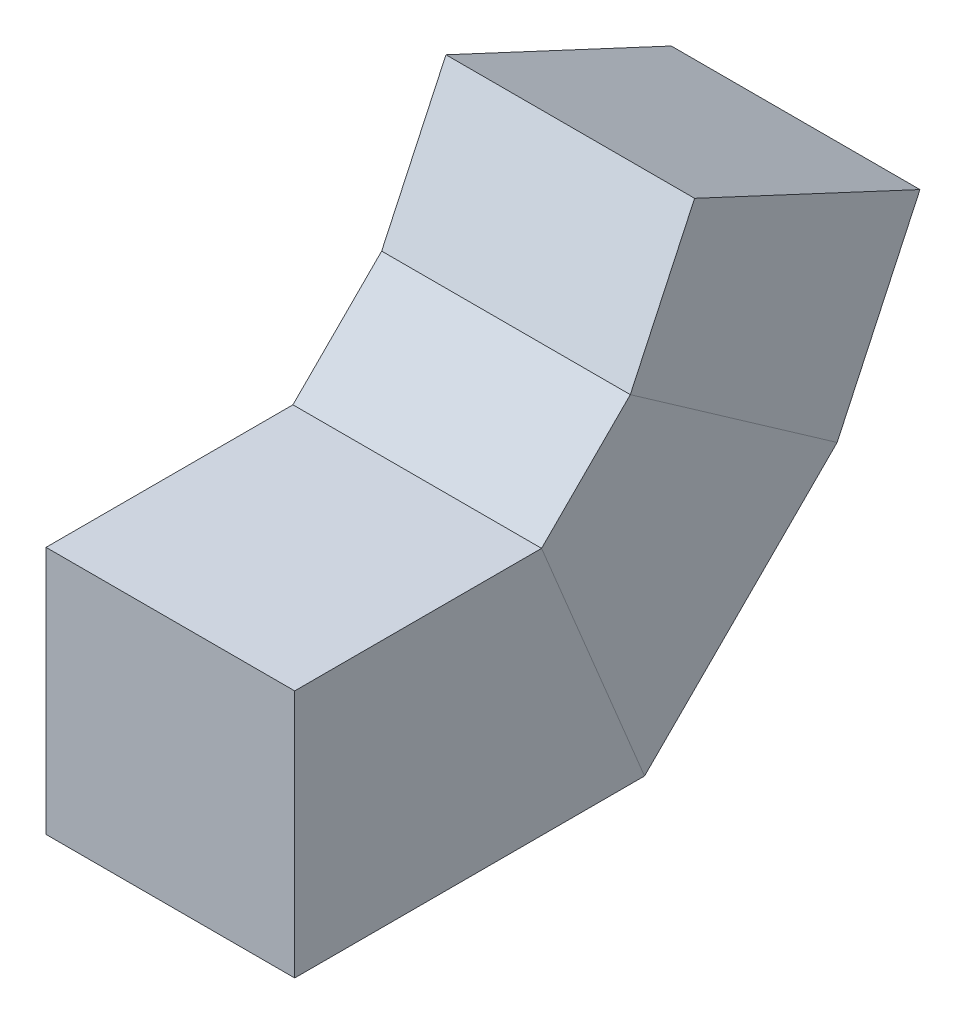
ISO-10303-21;
HEADER;
FILE_DESCRIPTION(('STEP AP214'),'2;1');
FILE_NAME('part.step','',(''),(''),'','','');
FILE_SCHEMA(('AUTOMOTIVE_DESIGN { 1 0 10303 214 1 1 1 1 }'));
ENDSEC;
DATA;
#1=APPLICATION_CONTEXT('core data for automotive mechanical design processes');
#2=APPLICATION_PROTOCOL_DEFINITION('international standard','automotive_design',2000,#1);
#3=PRODUCT_CONTEXT('',#1,'mechanical');
#4=PRODUCT('Part','Part','',(#3));
#5=PRODUCT_RELATED_PRODUCT_CATEGORY('part','',(#4));
#6=PRODUCT_DEFINITION_FORMATION('','',#4);
#7=PRODUCT_DEFINITION_CONTEXT('part definition',#1,'design');
#8=PRODUCT_DEFINITION('design','',#6,#7);
#9=PRODUCT_DEFINITION_SHAPE('','',#8);
#10=(LENGTH_UNIT() NAMED_UNIT(*) SI_UNIT(.MILLI.,.METRE.));
#11=(NAMED_UNIT(*) PLANE_ANGLE_UNIT() SI_UNIT($,.RADIAN.));
#12=(NAMED_UNIT(*) SI_UNIT($,.STERADIAN.) SOLID_ANGLE_UNIT());
#13=UNCERTAINTY_MEASURE_WITH_UNIT(LENGTH_MEASURE(1.E-05),#10,'distance_accuracy_value','');
#14=(GEOMETRIC_REPRESENTATION_CONTEXT(3) GLOBAL_UNCERTAINTY_ASSIGNED_CONTEXT((#13)) GLOBAL_UNIT_ASSIGNED_CONTEXT((#10,
#11,#12)) REPRESENTATION_CONTEXT('',''));
#15=CARTESIAN_POINT('',(0.,0.,0.));
#16=DIRECTION('',(0.,0.,1.));
#17=DIRECTION('',(1.,0.,0.));
#18=AXIS2_PLACEMENT_3D('',#15,#16,#17);
#19=CARTESIAN_POINT('',(0.,120.010087587489,-206.151820816773));
#20=DIRECTION('',(0.,0.90630778703665,-0.422618261740699));
#21=DIRECTION('',(-1.,0.,0.));
#22=AXIS2_PLACEMENT_3D('',#19,#20,#21);
#23=PLANE('',#22);
#24=DIRECTION('',(0.,-0.422618261740699,-0.90630778703665));
#25=VECTOR('',#24,1.);
#26=CARTESIAN_POINT('',(-50.,141.141000674524,-160.83643146494));
#27=LINE('',#26,#25);
#28=CARTESIAN_POINT('',(-50.,141.141000674524,-160.83643146494));
#29=VERTEX_POINT('',#28);
#30=CARTESIAN_POINT('',(-50.,98.8791745004545,-251.467210168605));
#31=VERTEX_POINT('',#30);
#32=EDGE_CURVE('E87',#29,#31,#27,.T.);
#33=ORIENTED_EDGE('',*,*,#32,.F.);
#34=DIRECTION('',(-1.,0.,0.));
#35=VECTOR('',#34,1.);
#36=CARTESIAN_POINT('',(50.,141.141000674524,-160.83643146494));
#37=LINE('',#36,#35);
#38=CARTESIAN_POINT('',(50.,141.141000674524,-160.83643146494));
#39=VERTEX_POINT('',#38);
#40=EDGE_CURVE('E94',#39,#29,#37,.T.);
#41=ORIENTED_EDGE('',*,*,#40,.F.);
#42=DIRECTION('',(0.,0.422618261740699,0.90630778703665));
#43=VECTOR('',#42,1.);
#44=CARTESIAN_POINT('',(50.,141.141000674524,-160.83643146494));
#45=LINE('',#44,#43);
#46=CARTESIAN_POINT('',(50.,98.8791745004544,-251.467210168605));
#47=VERTEX_POINT('',#46);
#48=EDGE_CURVE('E103',#47,#39,#45,.T.);
#49=ORIENTED_EDGE('',*,*,#48,.F.);
#50=DIRECTION('',(1.,0.,0.));
#51=VECTOR('',#50,1.);
#52=CARTESIAN_POINT('',(50.,98.8791745004544,-251.467210168605));
#53=LINE('',#52,#51);
#54=EDGE_CURVE('E105',#31,#47,#53,.T.);
#55=ORIENTED_EDGE('',*,*,#54,.F.);
#56=EDGE_LOOP('',(#33,#41,#49,#55));
#57=FACE_BOUND('',#56,.T.);
#58=ADVANCED_FACE('F39',(#57),#23,.T.);
#59=CARTESIAN_POINT('',(0.,0.,0.));
#60=DIRECTION('',(0.,0.,-1.));
#61=DIRECTION('',(-1.,0.,0.));
#62=AXIS2_PLACEMENT_3D('',#59,#60,#61);
#63=PLANE('',#62);
#64=DIRECTION('',(0.,-1.,0.));
#65=VECTOR('',#64,1.);
#66=CARTESIAN_POINT('',(-50.,50.,0.));
#67=LINE('',#66,#65);
#68=CARTESIAN_POINT('',(-50.,50.,0.));
#69=VERTEX_POINT('',#68);
#70=CARTESIAN_POINT('',(-50.,-50.,0.));
#71=VERTEX_POINT('',#70);
#72=EDGE_CURVE('E155',#69,#71,#67,.T.);
#73=ORIENTED_EDGE('',*,*,#72,.T.);
#74=DIRECTION('',(1.,0.,0.));
#75=VECTOR('',#74,1.);
#76=CARTESIAN_POINT('',(50.,-50.,0.));
#77=LINE('',#76,#75);
#78=CARTESIAN_POINT('',(50.,-50.,0.));
#79=VERTEX_POINT('',#78);
#80=EDGE_CURVE('E175',#71,#79,#77,.T.);
#81=ORIENTED_EDGE('',*,*,#80,.T.);
#82=DIRECTION('',(0.,1.,0.));
#83=VECTOR('',#82,1.);
#84=CARTESIAN_POINT('',(50.,50.,0.));
#85=LINE('',#84,#83);
#86=CARTESIAN_POINT('',(50.,50.,0.));
#87=VERTEX_POINT('',#86);
#88=EDGE_CURVE('E167',#79,#87,#85,.T.);
#89=ORIENTED_EDGE('',*,*,#88,.T.);
#90=DIRECTION('',(-1.,0.,0.));
#91=VECTOR('',#90,1.);
#92=CARTESIAN_POINT('',(50.,50.,0.));
#93=LINE('',#92,#91);
#94=EDGE_CURVE('E162',#87,#69,#93,.T.);
#95=ORIENTED_EDGE('',*,*,#94,.T.);
#96=EDGE_LOOP('',(#73,#81,#89,#95));
#97=FACE_BOUND('',#96,.T.);
#98=ADVANCED_FACE('F231',(#97),#63,.F.);
#99=CARTESIAN_POINT('',(-50.,68.8194664408142,-127.112346202242));
#100=DIRECTION('',(1.,0.,0.));
#101=DIRECTION('',(0.,0.,-1.));
#102=AXIS2_PLACEMENT_3D('',#99,#100,#101);
#103=PLANE('',#102);
#104=DIRECTION('',(0.,0.573576436351046,0.819152044288992));
#105=VECTOR('',#104,1.);
#106=CARTESIAN_POINT('',(-50.,95.0587422045921,-121.598840500455));
#107=LINE('',#106,#105);
#108=CARTESIAN_POINT('',(-50.,27.4473036238517,-218.157981742506));
#109=VERTEX_POINT('',#108);
#110=CARTESIAN_POINT('',(-50.,85.6897813659959,-134.979103247341));
#111=VERTEX_POINT('',#110);
#112=EDGE_CURVE('E110',#109,#111,#107,.T.);
#113=ORIENTED_EDGE('',*,*,#112,.T.);
#114=DIRECTION('',(0.,0.90630778703665,-0.422618261740699));
#115=VECTOR('',#114,1.);
#116=CARTESIAN_POINT('',(-50.,68.8194664408142,-127.112346202242));
#117=LINE('',#116,#115);
#118=EDGE_CURVE('E42',#111,#29,#117,.T.);
#119=ORIENTED_EDGE('',*,*,#118,.T.);
#120=ORIENTED_EDGE('',*,*,#32,.T.);
#121=DIRECTION('',(0.,0.90630778703665,-0.422618261740699));
#122=VECTOR('',#121,1.);
#123=CARTESIAN_POINT('',(-50.,26.5576402667443,-217.743124905907));
#124=LINE('',#123,#122);
#125=EDGE_CURVE('E114',#109,#31,#124,.T.);
#126=ORIENTED_EDGE('',*,*,#125,.F.);
#127=EDGE_LOOP('',(#113,#119,#120,#126));
#128=FACE_BOUND('',#127,.T.);
#129=ADVANCED_FACE('F109',(#128),#103,.F.);
#130=CARTESIAN_POINT('',(50.,26.5576402667443,-217.743124905907));
#131=DIRECTION('',(0.,0.422618261740698,0.90630778703665));
#132=DIRECTION('',(0.,-0.90630778703665,0.422618261740699));
#133=AXIS2_PLACEMENT_3D('',#130,#131,#132);
#134=PLANE('',#133);
#135=DIRECTION('',(-1.,0.,0.));
#136=VECTOR('',#135,1.);
#137=CARTESIAN_POINT('',(50.,27.4473036238517,-218.157981742506));
#138=LINE('',#137,#136);
#139=CARTESIAN_POINT('',(50.,27.4473036238517,-218.157981742506));
#140=VERTEX_POINT('',#139);
#141=EDGE_CURVE('E152',#140,#109,#138,.T.);
#142=ORIENTED_EDGE('',*,*,#141,.T.);
#143=ORIENTED_EDGE('',*,*,#125,.T.);
#144=ORIENTED_EDGE('',*,*,#54,.T.);
#145=DIRECTION('',(0.,0.90630778703665,-0.422618261740699));
#146=VECTOR('',#145,1.);
#147=CARTESIAN_POINT('',(50.,26.5576402667443,-217.743124905907));
#148=LINE('',#147,#146);
#149=EDGE_CURVE('E120',#140,#47,#148,.T.);
#150=ORIENTED_EDGE('',*,*,#149,.F.);
#151=EDGE_LOOP('',(#142,#143,#144,#150));
#152=FACE_BOUND('',#151,.T.);
#153=ADVANCED_FACE('F237',(#152),#134,.F.);
#154=CARTESIAN_POINT('',(50.,68.8194664408142,-127.112346202242));
#155=DIRECTION('',(-1.,0.,0.));
#156=DIRECTION('',(0.,0.,1.));
#157=AXIS2_PLACEMENT_3D('',#154,#155,#156);
#158=PLANE('',#157);
#159=DIRECTION('',(0.,-0.573576436351046,-0.819152044288992));
#160=VECTOR('',#159,1.);
#161=CARTESIAN_POINT('',(50.,95.0587422045921,-121.598840500455));
#162=LINE('',#161,#160);
#163=CARTESIAN_POINT('',(50.,85.6897813659959,-134.979103247341));
#164=VERTEX_POINT('',#163);
#165=EDGE_CURVE('E148',#164,#140,#162,.T.);
#166=ORIENTED_EDGE('',*,*,#165,.T.);
#167=ORIENTED_EDGE('',*,*,#149,.T.);
#168=ORIENTED_EDGE('',*,*,#48,.T.);
#169=DIRECTION('',(0.,0.90630778703665,-0.422618261740699));
#170=VECTOR('',#169,1.);
#171=CARTESIAN_POINT('',(50.,68.8194664408142,-127.112346202242));
#172=LINE('',#171,#170);
#173=EDGE_CURVE('E99',#164,#39,#172,.T.);
#174=ORIENTED_EDGE('',*,*,#173,.F.);
#175=EDGE_LOOP('',(#166,#167,#168,#174));
#176=FACE_BOUND('',#175,.T.);
#177=ADVANCED_FACE('F263',(#176),#158,.F.);
#178=CARTESIAN_POINT('',(50.,68.8194664408142,-127.112346202242));
#179=DIRECTION('',(0.,-0.422618261740698,-0.90630778703665));
#180=DIRECTION('',(0.,0.90630778703665,-0.422618261740699));
#181=AXIS2_PLACEMENT_3D('',#178,#179,#180);
#182=PLANE('',#181);
#183=DIRECTION('',(1.,0.,0.));
#184=VECTOR('',#183,1.);
#185=CARTESIAN_POINT('',(50.,85.6897813659959,-134.979103247341));
#186=LINE('',#185,#184);
#187=EDGE_CURVE('E135',#111,#164,#186,.T.);
#188=ORIENTED_EDGE('',*,*,#187,.T.);
#189=ORIENTED_EDGE('',*,*,#173,.T.);
#190=ORIENTED_EDGE('',*,*,#40,.T.);
#191=ORIENTED_EDGE('',*,*,#118,.F.);
#192=EDGE_LOOP('',(#188,#189,#190,#191));
#193=FACE_BOUND('',#192,.T.);
#194=ADVANCED_FACE('F96',(#193),#182,.F.);
#195=CARTESIAN_POINT('',(50.,19.1755013464688,-68.4648232278141));
#196=DIRECTION('',(0.,-0.707106781186547,-0.707106781186548));
#197=DIRECTION('',(0.,0.707106781186548,-0.707106781186547));
#198=AXIS2_PLACEMENT_3D('',#195,#196,#197);
#199=PLANE('',#198);
#200=DIRECTION('',(0.,0.707106781186548,-0.707106781186547));
#201=VECTOR('',#200,1.);
#202=CARTESIAN_POINT('',(-50.,19.1755013464688,-68.4648232278141));
#203=LINE('',#202,#201);
#204=CARTESIAN_POINT('',(-50.,50.,-99.2893218813452));
#205=VERTEX_POINT('',#204);
#206=EDGE_CURVE('E136',#205,#111,#203,.T.);
#207=ORIENTED_EDGE('',*,*,#206,.F.);
#208=DIRECTION('',(1.,0.,0.));
#209=VECTOR('',#208,1.);
#210=CARTESIAN_POINT('',(50.,50.,-99.2893218813452));
#211=LINE('',#210,#209);
#212=CARTESIAN_POINT('',(50.,50.,-99.2893218813452));
#213=VERTEX_POINT('',#212);
#214=EDGE_CURVE('E160',#205,#213,#211,.T.);
#215=ORIENTED_EDGE('',*,*,#214,.T.);
#216=DIRECTION('',(0.,0.707106781186548,-0.707106781186547));
#217=VECTOR('',#216,1.);
#218=CARTESIAN_POINT('',(50.,19.1755013464688,-68.4648232278141));
#219=LINE('',#218,#217);
#220=EDGE_CURVE('E113',#213,#164,#219,.T.);
#221=ORIENTED_EDGE('',*,*,#220,.T.);
#222=ORIENTED_EDGE('',*,*,#187,.F.);
#223=EDGE_LOOP('',(#207,#215,#221,#222));
#224=FACE_BOUND('',#223,.T.);
#225=ADVANCED_FACE('F222',(#224),#199,.F.);
#226=CARTESIAN_POINT('',(50.,19.1755013464688,-68.4648232278141));
#227=DIRECTION('',(-1.,0.,0.));
#228=DIRECTION('',(0.,0.,1.));
#229=AXIS2_PLACEMENT_3D('',#226,#227,#228);
#230=PLANE('',#229);
#231=ORIENTED_EDGE('',*,*,#220,.F.);
#232=DIRECTION('',(0.,-0.923879532511287,-0.38268343236509));
#233=VECTOR('',#232,1.);
#234=CARTESIAN_POINT('',(50.,85.1040764008565,-84.7487373415291));
#235=LINE('',#234,#233);
#236=CARTESIAN_POINT('',(50.,-50.,-140.710678118655));
#237=VERTEX_POINT('',#236);
#238=EDGE_CURVE('E49',#213,#237,#235,.T.);
#239=ORIENTED_EDGE('',*,*,#238,.T.);
#240=DIRECTION('',(0.,0.707106781186548,-0.707106781186547));
#241=VECTOR('',#240,1.);
#242=CARTESIAN_POINT('',(50.,-51.5351767721859,-139.175501346469));
#243=LINE('',#242,#241);
#244=EDGE_CURVE('E118',#237,#140,#243,.T.);
#245=ORIENTED_EDGE('',*,*,#244,.T.);
#246=ORIENTED_EDGE('',*,*,#165,.F.);
#247=EDGE_LOOP('',(#231,#239,#245,#246));
#248=FACE_BOUND('',#247,.T.);
#249=ADVANCED_FACE('F198',(#248),#230,.F.);
#250=CARTESIAN_POINT('',(50.,-51.5351767721859,-139.175501346469));
#251=DIRECTION('',(0.,0.707106781186547,0.707106781186548));
#252=DIRECTION('',(0.,-0.707106781186548,0.707106781186547));
#253=AXIS2_PLACEMENT_3D('',#250,#251,#252);
#254=PLANE('',#253);
#255=ORIENTED_EDGE('',*,*,#244,.F.);
#256=DIRECTION('',(-1.,0.,0.));
#257=VECTOR('',#256,1.);
#258=CARTESIAN_POINT('',(50.,-50.,-140.710678118655));
#259=LINE('',#258,#257);
#260=CARTESIAN_POINT('',(-50.,-50.,-140.710678118655));
#261=VERTEX_POINT('',#260);
#262=EDGE_CURVE('E11',#237,#261,#259,.T.);
#263=ORIENTED_EDGE('',*,*,#262,.T.);
#264=DIRECTION('',(0.,0.707106781186548,-0.707106781186547));
#265=VECTOR('',#264,1.);
#266=CARTESIAN_POINT('',(-50.,-51.5351767721859,-139.175501346469));
#267=LINE('',#266,#265);
#268=EDGE_CURVE('E139',#261,#109,#267,.T.);
#269=ORIENTED_EDGE('',*,*,#268,.T.);
#270=ORIENTED_EDGE('',*,*,#141,.F.);
#271=EDGE_LOOP('',(#255,#263,#269,#270));
#272=FACE_BOUND('',#271,.T.);
#273=ADVANCED_FACE('F253',(#272),#254,.F.);
#274=CARTESIAN_POINT('',(-50.,19.1755013464688,-68.4648232278141));
#275=DIRECTION('',(1.,0.,0.));
#276=DIRECTION('',(0.,0.,-1.));
#277=AXIS2_PLACEMENT_3D('',#274,#275,#276);
#278=PLANE('',#277);
#279=ORIENTED_EDGE('',*,*,#268,.F.);
#280=DIRECTION('',(0.,0.923879532511287,0.38268343236509));
#281=VECTOR('',#280,1.);
#282=CARTESIAN_POINT('',(-50.,85.1040764008565,-84.7487373415292));
#283=LINE('',#282,#281);
#284=EDGE_CURVE('E156',#261,#205,#283,.T.);
#285=ORIENTED_EDGE('',*,*,#284,.T.);
#286=ORIENTED_EDGE('',*,*,#206,.T.);
#287=ORIENTED_EDGE('',*,*,#112,.F.);
#288=EDGE_LOOP('',(#279,#285,#286,#287));
#289=FACE_BOUND('',#288,.T.);
#290=ADVANCED_FACE('F225',(#289),#278,.F.);
#291=CARTESIAN_POINT('',(50.,50.,0.));
#292=DIRECTION('',(0.,-1.,0.));
#293=DIRECTION('',(1.,0.,0.));
#294=AXIS2_PLACEMENT_3D('',#291,#292,#293);
#295=PLANE('',#294);
#296=DIRECTION('',(0.,0.,-1.));
#297=VECTOR('',#296,1.);
#298=CARTESIAN_POINT('',(-50.,50.,0.));
#299=LINE('',#298,#297);
#300=EDGE_CURVE('E166',#69,#205,#299,.T.);
#301=ORIENTED_EDGE('',*,*,#300,.F.);
#302=ORIENTED_EDGE('',*,*,#94,.F.);
#303=DIRECTION('',(0.,0.,-1.));
#304=VECTOR('',#303,1.);
#305=CARTESIAN_POINT('',(50.,50.,0.));
#306=LINE('',#305,#304);
#307=EDGE_CURVE('E161',#87,#213,#306,.T.);
#308=ORIENTED_EDGE('',*,*,#307,.T.);
#309=ORIENTED_EDGE('',*,*,#214,.F.);
#310=EDGE_LOOP('',(#301,#302,#308,#309));
#311=FACE_BOUND('',#310,.T.);
#312=ADVANCED_FACE('F220',(#311),#295,.F.);
#313=CARTESIAN_POINT('',(50.,50.,0.));
#314=DIRECTION('',(-1.,0.,0.));
#315=DIRECTION('',(0.,-1.,0.));
#316=AXIS2_PLACEMENT_3D('',#313,#314,#315);
#317=PLANE('',#316);
#318=ORIENTED_EDGE('',*,*,#307,.F.);
#319=ORIENTED_EDGE('',*,*,#88,.F.);
#320=DIRECTION('',(0.,0.,-1.));
#321=VECTOR('',#320,1.);
#322=CARTESIAN_POINT('',(50.,-50.,0.));
#323=LINE('',#322,#321);
#324=EDGE_CURVE('E171',#79,#237,#323,.T.);
#325=ORIENTED_EDGE('',*,*,#324,.T.);
#326=ORIENTED_EDGE('',*,*,#238,.F.);
#327=EDGE_LOOP('',(#318,#319,#325,#326));
#328=FACE_BOUND('',#327,.T.);
#329=ADVANCED_FACE('F202',(#328),#317,.F.);
#330=CARTESIAN_POINT('',(50.,-50.,0.));
#331=DIRECTION('',(0.,1.,0.));
#332=DIRECTION('',(-1.,0.,0.));
#333=AXIS2_PLACEMENT_3D('',#330,#331,#332);
#334=PLANE('',#333);
#335=ORIENTED_EDGE('',*,*,#324,.F.);
#336=ORIENTED_EDGE('',*,*,#80,.F.);
#337=DIRECTION('',(0.,0.,-1.));
#338=VECTOR('',#337,1.);
#339=CARTESIAN_POINT('',(-50.,-50.,0.));
#340=LINE('',#339,#338);
#341=EDGE_CURVE('E179',#71,#261,#340,.T.);
#342=ORIENTED_EDGE('',*,*,#341,.T.);
#343=ORIENTED_EDGE('',*,*,#262,.F.);
#344=EDGE_LOOP('',(#335,#336,#342,#343));
#345=FACE_BOUND('',#344,.T.);
#346=ADVANCED_FACE('F205',(#345),#334,.F.);
#347=CARTESIAN_POINT('',(-50.,50.,0.));
#348=DIRECTION('',(1.,0.,0.));
#349=DIRECTION('',(0.,1.,0.));
#350=AXIS2_PLACEMENT_3D('',#347,#348,#349);
#351=PLANE('',#350);
#352=ORIENTED_EDGE('',*,*,#341,.F.);
#353=ORIENTED_EDGE('',*,*,#72,.F.);
#354=ORIENTED_EDGE('',*,*,#300,.T.);
#355=ORIENTED_EDGE('',*,*,#284,.F.);
#356=EDGE_LOOP('',(#352,#353,#354,#355));
#357=FACE_BOUND('',#356,.T.);
#358=ADVANCED_FACE('F229',(#357),#351,.F.);
#359=CLOSED_SHELL('',(#58,#98,#129,#153,#177,#194,#225,#249,#273,#290,#312,#329,#346,#358));
#360=MANIFOLD_SOLID_BREP('B2',#359);
#361=ADVANCED_BREP_SHAPE_REPRESENTATION('',(#18,#360),#14);
#362=SHAPE_DEFINITION_REPRESENTATION(#9,#361);
ENDSEC;
END-ISO-10303-21;
